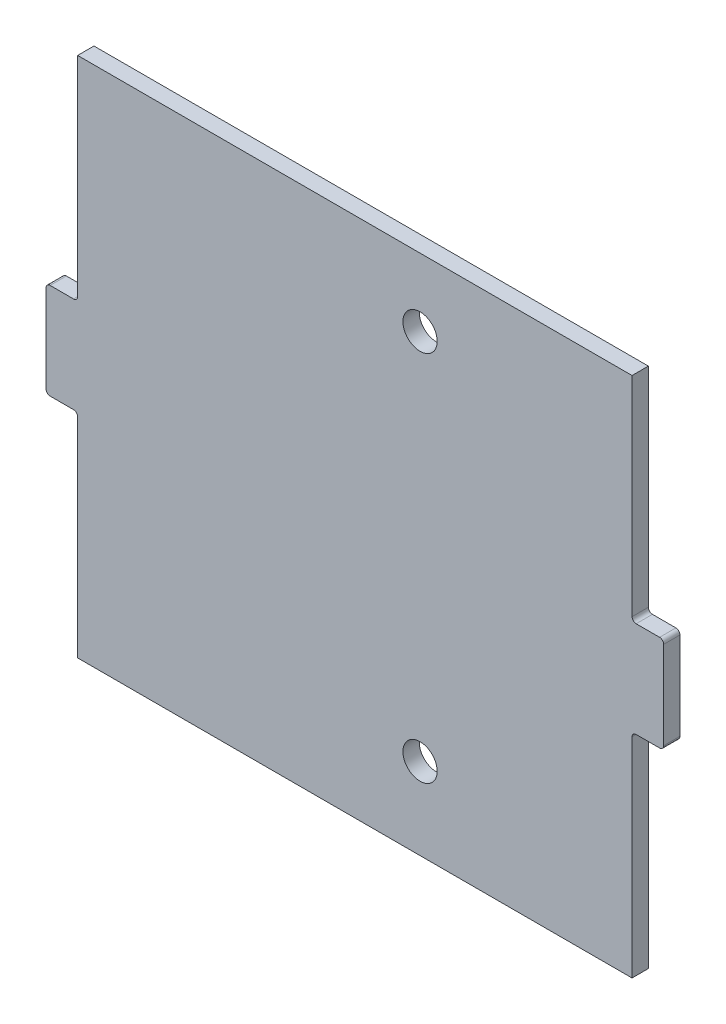
ISO-10303-21;
HEADER;
FILE_DESCRIPTION(('STEP AP214'),'2;1');
FILE_NAME('part.step','',(''),(''),'','','');
FILE_SCHEMA(('AUTOMOTIVE_DESIGN { 1 0 10303 214 1 1 1 1 }'));
ENDSEC;
DATA;
#1=APPLICATION_CONTEXT('core data for automotive mechanical design processes');
#2=APPLICATION_PROTOCOL_DEFINITION('international standard','automotive_design',2000,#1);
#3=PRODUCT_CONTEXT('',#1,'mechanical');
#4=PRODUCT('Part','Part','',(#3));
#5=PRODUCT_RELATED_PRODUCT_CATEGORY('part','',(#4));
#6=PRODUCT_DEFINITION_FORMATION('','',#4);
#7=PRODUCT_DEFINITION_CONTEXT('part definition',#1,'design');
#8=PRODUCT_DEFINITION('design','',#6,#7);
#9=PRODUCT_DEFINITION_SHAPE('','',#8);
#10=(LENGTH_UNIT() NAMED_UNIT(*) SI_UNIT(.MILLI.,.METRE.));
#11=(NAMED_UNIT(*) PLANE_ANGLE_UNIT() SI_UNIT($,.RADIAN.));
#12=(NAMED_UNIT(*) SI_UNIT($,.STERADIAN.) SOLID_ANGLE_UNIT());
#13=UNCERTAINTY_MEASURE_WITH_UNIT(LENGTH_MEASURE(1.E-05),#10,'distance_accuracy_value','');
#14=(GEOMETRIC_REPRESENTATION_CONTEXT(3) GLOBAL_UNCERTAINTY_ASSIGNED_CONTEXT((#13)) GLOBAL_UNIT_ASSIGNED_CONTEXT((#10,
#11,#12)) REPRESENTATION_CONTEXT('',''));
#15=CARTESIAN_POINT('',(0.,0.,0.));
#16=DIRECTION('',(0.,0.,1.));
#17=DIRECTION('',(1.,0.,0.));
#18=AXIS2_PLACEMENT_3D('',#15,#16,#17);
#19=CARTESIAN_POINT('',(215.9,-38.1,6.35));
#20=DIRECTION('',(-1.,0.,0.));
#21=DIRECTION('',(0.,-1.,0.));
#22=AXIS2_PLACEMENT_3D('',#19,#20,#21);
#23=PLANE('',#22);
#24=DIRECTION('',(0.,1.,0.));
#25=VECTOR('',#24,1.);
#26=CARTESIAN_POINT('',(215.9,-38.1,-6.35));
#27=LINE('',#26,#25);
#28=CARTESIAN_POINT('',(215.9,-203.2,-6.35));
#29=VERTEX_POINT('',#28);
#30=CARTESIAN_POINT('',(215.9,-40.513,-6.35));
#31=VERTEX_POINT('',#30);
#32=EDGE_CURVE('E202',#29,#31,#27,.T.);
#33=ORIENTED_EDGE('',*,*,#32,.T.);
#34=DIRECTION('',(0.,0.,-1.));
#35=VECTOR('',#34,1.);
#36=CARTESIAN_POINT('',(215.9,-40.513,6.35));
#37=LINE('',#36,#35);
#38=CARTESIAN_POINT('',(215.9,-40.513,6.35));
#39=VERTEX_POINT('',#38);
#40=EDGE_CURVE('E359',#31,#39,#37,.F.);
#41=ORIENTED_EDGE('',*,*,#40,.T.);
#42=DIRECTION('',(0.,1.,0.));
#43=VECTOR('',#42,1.);
#44=CARTESIAN_POINT('',(215.9,-38.1,6.35));
#45=LINE('',#44,#43);
#46=CARTESIAN_POINT('',(215.9,-203.2,6.35));
#47=VERTEX_POINT('',#46);
#48=EDGE_CURVE('E205',#47,#39,#45,.T.);
#49=ORIENTED_EDGE('',*,*,#48,.F.);
#50=DIRECTION('',(0.,0.,-1.));
#51=VECTOR('',#50,1.);
#52=CARTESIAN_POINT('',(215.9,-203.2,6.35));
#53=LINE('',#52,#51);
#54=EDGE_CURVE('E190',#47,#29,#53,.T.);
#55=ORIENTED_EDGE('',*,*,#54,.T.);
#56=EDGE_LOOP('',(#33,#41,#49,#55));
#57=FACE_BOUND('',#56,.T.);
#58=ADVANCED_FACE('F44',(#57),#23,.F.);
#59=CARTESIAN_POINT('',(215.9,-37.338,6.35));
#60=DIRECTION('',(0.,1.,0.));
#61=DIRECTION('',(-1.,0.,0.));
#62=AXIS2_PLACEMENT_3D('',#59,#60,#61);
#63=PLANE('',#62);
#64=DIRECTION('',(1.,0.,0.));
#65=VECTOR('',#64,1.);
#66=CARTESIAN_POINT('',(215.9,-37.338,-6.35));
#67=LINE('',#66,#65);
#68=CARTESIAN_POINT('',(219.075,-37.338,-6.35));
#69=VERTEX_POINT('',#68);
#70=CARTESIAN_POINT('',(237.363,-37.338,-6.35));
#71=VERTEX_POINT('',#70);
#72=EDGE_CURVE('E207',#69,#71,#67,.T.);
#73=ORIENTED_EDGE('',*,*,#72,.T.);
#74=DIRECTION('',(0.,0.,-1.));
#75=VECTOR('',#74,1.);
#76=CARTESIAN_POINT('',(237.363,-37.338,6.35));
#77=LINE('',#76,#75);
#78=CARTESIAN_POINT('',(237.363,-37.338,6.35));
#79=VERTEX_POINT('',#78);
#80=EDGE_CURVE('E356',#71,#79,#77,.F.);
#81=ORIENTED_EDGE('',*,*,#80,.T.);
#82=DIRECTION('',(1.,0.,0.));
#83=VECTOR('',#82,1.);
#84=CARTESIAN_POINT('',(215.9,-37.338,6.35));
#85=LINE('',#84,#83);
#86=CARTESIAN_POINT('',(219.075,-37.338,6.35));
#87=VERTEX_POINT('',#86);
#88=EDGE_CURVE('E238',#87,#79,#85,.T.);
#89=ORIENTED_EDGE('',*,*,#88,.F.);
#90=DIRECTION('',(0.,0.,-1.));
#91=VECTOR('',#90,1.);
#92=CARTESIAN_POINT('',(219.075,-37.338,-6.35));
#93=LINE('',#92,#91);
#94=EDGE_CURVE('E352',#87,#69,#93,.T.);
#95=ORIENTED_EDGE('',*,*,#94,.T.);
#96=EDGE_LOOP('',(#73,#81,#89,#95));
#97=FACE_BOUND('',#96,.T.);
#98=ADVANCED_FACE('F412',(#97),#63,.F.);
#99=CARTESIAN_POINT('',(240.538,38.1,6.35));
#100=DIRECTION('',(-1.,0.,0.));
#101=DIRECTION('',(0.,0.,1.));
#102=AXIS2_PLACEMENT_3D('',#99,#100,#101);
#103=PLANE('',#102);
#104=DIRECTION('',(0.,1.,0.));
#105=VECTOR('',#104,1.);
#106=CARTESIAN_POINT('',(240.538,38.1,-6.35));
#107=LINE('',#106,#105);
#108=CARTESIAN_POINT('',(240.538,-34.163,-6.35));
#109=VERTEX_POINT('',#108);
#110=CARTESIAN_POINT('',(240.538,34.163,-6.35));
#111=VERTEX_POINT('',#110);
#112=EDGE_CURVE('E243',#109,#111,#107,.T.);
#113=ORIENTED_EDGE('',*,*,#112,.T.);
#114=DIRECTION('',(0.,0.,-1.));
#115=VECTOR('',#114,1.);
#116=CARTESIAN_POINT('',(240.538,34.163,6.35));
#117=LINE('',#116,#115);
#118=CARTESIAN_POINT('',(240.538,34.163,6.35));
#119=VERTEX_POINT('',#118);
#120=EDGE_CURVE('E349',#111,#119,#117,.F.);
#121=ORIENTED_EDGE('',*,*,#120,.T.);
#122=DIRECTION('',(0.,1.,0.));
#123=VECTOR('',#122,1.);
#124=CARTESIAN_POINT('',(240.538,38.1,6.35));
#125=LINE('',#124,#123);
#126=CARTESIAN_POINT('',(240.538,-34.163,6.35));
#127=VERTEX_POINT('',#126);
#128=EDGE_CURVE('E247',#127,#119,#125,.T.);
#129=ORIENTED_EDGE('',*,*,#128,.F.);
#130=DIRECTION('',(0.,0.,-1.));
#131=VECTOR('',#130,1.);
#132=CARTESIAN_POINT('',(240.538,-34.163,6.35));
#133=LINE('',#132,#131);
#134=EDGE_CURVE('E345',#127,#109,#133,.T.);
#135=ORIENTED_EDGE('',*,*,#134,.T.);
#136=EDGE_LOOP('',(#113,#121,#129,#135));
#137=FACE_BOUND('',#136,.T.);
#138=ADVANCED_FACE('F418',(#137),#103,.F.);
#139=CARTESIAN_POINT('',(215.9,37.338,6.35));
#140=DIRECTION('',(0.,-1.,0.));
#141=DIRECTION('',(0.,0.,-1.));
#142=AXIS2_PLACEMENT_3D('',#139,#140,#141);
#143=PLANE('',#142);
#144=DIRECTION('',(-1.,0.,0.));
#145=VECTOR('',#144,1.);
#146=CARTESIAN_POINT('',(215.9,37.338,-6.35));
#147=LINE('',#146,#145);
#148=CARTESIAN_POINT('',(237.363,37.338,-6.35));
#149=VERTEX_POINT('',#148);
#150=CARTESIAN_POINT('',(219.075,37.338,-6.35));
#151=VERTEX_POINT('',#150);
#152=EDGE_CURVE('E254',#149,#151,#147,.T.);
#153=ORIENTED_EDGE('',*,*,#152,.T.);
#154=DIRECTION('',(0.,0.,-1.));
#155=VECTOR('',#154,1.);
#156=CARTESIAN_POINT('',(219.075,37.338,6.35));
#157=LINE('',#156,#155);
#158=CARTESIAN_POINT('',(219.075,37.338,6.35));
#159=VERTEX_POINT('',#158);
#160=EDGE_CURVE('E342',#151,#159,#157,.F.);
#161=ORIENTED_EDGE('',*,*,#160,.T.);
#162=DIRECTION('',(-1.,0.,0.));
#163=VECTOR('',#162,1.);
#164=CARTESIAN_POINT('',(215.9,37.338,6.35));
#165=LINE('',#164,#163);
#166=CARTESIAN_POINT('',(237.363,37.338,6.35));
#167=VERTEX_POINT('',#166);
#168=EDGE_CURVE('E235',#167,#159,#165,.T.);
#169=ORIENTED_EDGE('',*,*,#168,.F.);
#170=DIRECTION('',(0.,0.,-1.));
#171=VECTOR('',#170,1.);
#172=CARTESIAN_POINT('',(237.363,37.338,6.35));
#173=LINE('',#172,#171);
#174=EDGE_CURVE('E338',#167,#149,#173,.T.);
#175=ORIENTED_EDGE('',*,*,#174,.T.);
#176=EDGE_LOOP('',(#153,#161,#169,#175));
#177=FACE_BOUND('',#176,.T.);
#178=ADVANCED_FACE('F426',(#177),#143,.F.);
#179=CARTESIAN_POINT('',(215.9,203.2,6.35));
#180=DIRECTION('',(-1.,0.,0.));
#181=DIRECTION('',(0.,-1.,0.));
#182=AXIS2_PLACEMENT_3D('',#179,#180,#181);
#183=PLANE('',#182);
#184=DIRECTION('',(0.,1.,0.));
#185=VECTOR('',#184,1.);
#186=CARTESIAN_POINT('',(215.9,203.2,6.35));
#187=LINE('',#186,#185);
#188=CARTESIAN_POINT('',(215.9,40.513,6.35));
#189=VERTEX_POINT('',#188);
#190=CARTESIAN_POINT('',(215.9,203.2,6.35));
#191=VERTEX_POINT('',#190);
#192=EDGE_CURVE('E232',#189,#191,#187,.T.);
#193=ORIENTED_EDGE('',*,*,#192,.F.);
#194=DIRECTION('',(0.,0.,-1.));
#195=VECTOR('',#194,1.);
#196=CARTESIAN_POINT('',(215.9,40.513,-6.35));
#197=LINE('',#196,#195);
#198=CARTESIAN_POINT('',(215.9,40.513,-6.35));
#199=VERTEX_POINT('',#198);
#200=EDGE_CURVE('E334',#189,#199,#197,.T.);
#201=ORIENTED_EDGE('',*,*,#200,.T.);
#202=DIRECTION('',(0.,1.,0.));
#203=VECTOR('',#202,1.);
#204=CARTESIAN_POINT('',(215.9,203.2,-6.35));
#205=LINE('',#204,#203);
#206=CARTESIAN_POINT('',(215.9,203.2,-6.35));
#207=VERTEX_POINT('',#206);
#208=EDGE_CURVE('E216',#199,#207,#205,.T.);
#209=ORIENTED_EDGE('',*,*,#208,.T.);
#210=DIRECTION('',(0.,0.,-1.));
#211=VECTOR('',#210,1.);
#212=CARTESIAN_POINT('',(215.9,203.2,6.35));
#213=LINE('',#212,#211);
#214=EDGE_CURVE('E683',#191,#207,#213,.T.);
#215=ORIENTED_EDGE('',*,*,#214,.F.);
#216=EDGE_LOOP('',(#193,#201,#209,#215));
#217=FACE_BOUND('',#216,.T.);
#218=ADVANCED_FACE('F422',(#217),#183,.F.);
#219=CARTESIAN_POINT('',(-215.9,203.2,6.35));
#220=DIRECTION('',(0.,-1.,0.));
#221=DIRECTION('',(0.,0.,-1.));
#222=AXIS2_PLACEMENT_3D('',#219,#220,#221);
#223=PLANE('',#222);
#224=DIRECTION('',(-1.,0.,0.));
#225=VECTOR('',#224,1.);
#226=CARTESIAN_POINT('',(-215.9,203.2,-6.35));
#227=LINE('',#226,#225);
#228=CARTESIAN_POINT('',(-215.9,203.2,-6.35));
#229=VERTEX_POINT('',#228);
#230=EDGE_CURVE('E688',#207,#229,#227,.T.);
#231=ORIENTED_EDGE('',*,*,#230,.T.);
#232=DIRECTION('',(0.,0.,-1.));
#233=VECTOR('',#232,1.);
#234=CARTESIAN_POINT('',(-215.9,203.2,6.35));
#235=LINE('',#234,#233);
#236=CARTESIAN_POINT('',(-215.9,203.2,6.35));
#237=VERTEX_POINT('',#236);
#238=EDGE_CURVE('E265',#237,#229,#235,.T.);
#239=ORIENTED_EDGE('',*,*,#238,.F.);
#240=DIRECTION('',(-1.,0.,0.));
#241=VECTOR('',#240,1.);
#242=CARTESIAN_POINT('',(-215.9,203.2,6.35));
#243=LINE('',#242,#241);
#244=EDGE_CURVE('E229',#191,#237,#243,.T.);
#245=ORIENTED_EDGE('',*,*,#244,.F.);
#246=ORIENTED_EDGE('',*,*,#214,.T.);
#247=EDGE_LOOP('',(#231,#239,#245,#246));
#248=FACE_BOUND('',#247,.T.);
#249=ADVANCED_FACE('F425',(#248),#223,.F.);
#250=CARTESIAN_POINT('',(-215.9,203.2,6.35));
#251=DIRECTION('',(1.,0.,0.));
#252=DIRECTION('',(0.,0.,-1.));
#253=AXIS2_PLACEMENT_3D('',#250,#251,#252);
#254=PLANE('',#253);
#255=DIRECTION('',(0.,-1.,0.));
#256=VECTOR('',#255,1.);
#257=CARTESIAN_POINT('',(-215.9,203.2,-6.35));
#258=LINE('',#257,#256);
#259=CARTESIAN_POINT('',(-215.9,40.513,-6.35));
#260=VERTEX_POINT('',#259);
#261=EDGE_CURVE('E687',#229,#260,#258,.T.);
#262=ORIENTED_EDGE('',*,*,#261,.T.);
#263=DIRECTION('',(0.,0.,-1.));
#264=VECTOR('',#263,1.);
#265=CARTESIAN_POINT('',(-215.9,40.513,6.35));
#266=LINE('',#265,#264);
#267=CARTESIAN_POINT('',(-215.9,40.513,6.35));
#268=VERTEX_POINT('',#267);
#269=EDGE_CURVE('E331',#260,#268,#266,.F.);
#270=ORIENTED_EDGE('',*,*,#269,.T.);
#271=DIRECTION('',(0.,-1.,0.));
#272=VECTOR('',#271,1.);
#273=CARTESIAN_POINT('',(-215.9,203.2,6.35));
#274=LINE('',#273,#272);
#275=EDGE_CURVE('E225',#237,#268,#274,.T.);
#276=ORIENTED_EDGE('',*,*,#275,.F.);
#277=ORIENTED_EDGE('',*,*,#238,.T.);
#278=EDGE_LOOP('',(#262,#270,#276,#277));
#279=FACE_BOUND('',#278,.T.);
#280=ADVANCED_FACE('F430',(#279),#254,.F.);
#281=CARTESIAN_POINT('',(-215.9,37.338,6.35));
#282=DIRECTION('',(0.,-1.,0.));
#283=DIRECTION('',(1.,0.,0.));
#284=AXIS2_PLACEMENT_3D('',#281,#282,#283);
#285=PLANE('',#284);
#286=DIRECTION('',(-1.,0.,0.));
#287=VECTOR('',#286,1.);
#288=CARTESIAN_POINT('',(-215.9,37.338,6.35));
#289=LINE('',#288,#287);
#290=CARTESIAN_POINT('',(-219.075,37.338,6.35));
#291=VERTEX_POINT('',#290);
#292=CARTESIAN_POINT('',(-237.363,37.338,6.35));
#293=VERTEX_POINT('',#292);
#294=EDGE_CURVE('E228',#291,#293,#289,.T.);
#295=ORIENTED_EDGE('',*,*,#294,.F.);
#296=DIRECTION('',(0.,0.,-1.));
#297=VECTOR('',#296,1.);
#298=CARTESIAN_POINT('',(-219.075,37.338,-6.35));
#299=LINE('',#298,#297);
#300=CARTESIAN_POINT('',(-219.075,37.338,-6.35));
#301=VERTEX_POINT('',#300);
#302=EDGE_CURVE('E327',#291,#301,#299,.T.);
#303=ORIENTED_EDGE('',*,*,#302,.T.);
#304=DIRECTION('',(-1.,0.,0.));
#305=VECTOR('',#304,1.);
#306=CARTESIAN_POINT('',(-215.9,37.338,-6.35));
#307=LINE('',#306,#305);
#308=CARTESIAN_POINT('',(-237.363,37.338,-6.35));
#309=VERTEX_POINT('',#308);
#310=EDGE_CURVE('E261',#301,#309,#307,.T.);
#311=ORIENTED_EDGE('',*,*,#310,.T.);
#312=DIRECTION('',(0.,0.,-1.));
#313=VECTOR('',#312,1.);
#314=CARTESIAN_POINT('',(-237.363,37.338,6.35));
#315=LINE('',#314,#313);
#316=EDGE_CURVE('E62',#309,#293,#315,.F.);
#317=ORIENTED_EDGE('',*,*,#316,.T.);
#318=EDGE_LOOP('',(#295,#303,#311,#317));
#319=FACE_BOUND('',#318,.T.);
#320=ADVANCED_FACE('F434',(#319),#285,.F.);
#321=CARTESIAN_POINT('',(-240.538,38.1,6.35));
#322=DIRECTION('',(1.,0.,0.));
#323=DIRECTION('',(0.,0.,-1.));
#324=AXIS2_PLACEMENT_3D('',#321,#322,#323);
#325=PLANE('',#324);
#326=DIRECTION('',(0.,-1.,0.));
#327=VECTOR('',#326,1.);
#328=CARTESIAN_POINT('',(-240.538,38.1,-6.35));
#329=LINE('',#328,#327);
#330=CARTESIAN_POINT('',(-240.538,34.163,-6.35));
#331=VERTEX_POINT('',#330);
#332=CARTESIAN_POINT('',(-240.538,-34.163,-6.35));
#333=VERTEX_POINT('',#332);
#334=EDGE_CURVE('E264',#331,#333,#329,.T.);
#335=ORIENTED_EDGE('',*,*,#334,.T.);
#336=DIRECTION('',(0.,0.,-1.));
#337=VECTOR('',#336,1.);
#338=CARTESIAN_POINT('',(-240.538,-34.163,6.35));
#339=LINE('',#338,#337);
#340=CARTESIAN_POINT('',(-240.538,-34.163,6.35));
#341=VERTEX_POINT('',#340);
#342=EDGE_CURVE('E310',#333,#341,#339,.F.);
#343=ORIENTED_EDGE('',*,*,#342,.T.);
#344=DIRECTION('',(0.,-1.,0.));
#345=VECTOR('',#344,1.);
#346=CARTESIAN_POINT('',(-240.538,38.1,6.35));
#347=LINE('',#346,#345);
#348=CARTESIAN_POINT('',(-240.538,34.163,6.35));
#349=VERTEX_POINT('',#348);
#350=EDGE_CURVE('E268',#349,#341,#347,.T.);
#351=ORIENTED_EDGE('',*,*,#350,.F.);
#352=DIRECTION('',(0.,0.,-1.));
#353=VECTOR('',#352,1.);
#354=CARTESIAN_POINT('',(-240.538,34.163,6.35));
#355=LINE('',#354,#353);
#356=EDGE_CURVE('E306',#349,#331,#355,.T.);
#357=ORIENTED_EDGE('',*,*,#356,.T.);
#358=EDGE_LOOP('',(#335,#343,#351,#357));
#359=FACE_BOUND('',#358,.T.);
#360=ADVANCED_FACE('F469',(#359),#325,.F.);
#361=CARTESIAN_POINT('',(-215.9,-37.338,6.35));
#362=DIRECTION('',(0.,1.,0.));
#363=DIRECTION('',(-1.,0.,0.));
#364=AXIS2_PLACEMENT_3D('',#361,#362,#363);
#365=PLANE('',#364);
#366=DIRECTION('',(1.,0.,0.));
#367=VECTOR('',#366,1.);
#368=CARTESIAN_POINT('',(-215.9,-37.338,-6.35));
#369=LINE('',#368,#367);
#370=CARTESIAN_POINT('',(-237.363,-37.338,-6.35));
#371=VERTEX_POINT('',#370);
#372=CARTESIAN_POINT('',(-219.075,-37.338,-6.35));
#373=VERTEX_POINT('',#372);
#374=EDGE_CURVE('E275',#371,#373,#369,.T.);
#375=ORIENTED_EDGE('',*,*,#374,.T.);
#376=DIRECTION('',(0.,0.,-1.));
#377=VECTOR('',#376,1.);
#378=CARTESIAN_POINT('',(-219.075,-37.338,6.35));
#379=LINE('',#378,#377);
#380=CARTESIAN_POINT('',(-219.075,-37.338,6.35));
#381=VERTEX_POINT('',#380);
#382=EDGE_CURVE('E291',#373,#381,#379,.F.);
#383=ORIENTED_EDGE('',*,*,#382,.T.);
#384=DIRECTION('',(1.,0.,0.));
#385=VECTOR('',#384,1.);
#386=CARTESIAN_POINT('',(-215.9,-37.338,6.35));
#387=LINE('',#386,#385);
#388=CARTESIAN_POINT('',(-237.363,-37.338,6.35));
#389=VERTEX_POINT('',#388);
#390=EDGE_CURVE('E224',#389,#381,#387,.T.);
#391=ORIENTED_EDGE('',*,*,#390,.F.);
#392=DIRECTION('',(0.,0.,-1.));
#393=VECTOR('',#392,1.);
#394=CARTESIAN_POINT('',(-237.363,-37.338,6.35));
#395=LINE('',#394,#393);
#396=EDGE_CURVE('E286',#389,#371,#395,.T.);
#397=ORIENTED_EDGE('',*,*,#396,.T.);
#398=EDGE_LOOP('',(#375,#383,#391,#397));
#399=FACE_BOUND('',#398,.T.);
#400=ADVANCED_FACE('F438',(#399),#365,.F.);
#401=CARTESIAN_POINT('',(-215.9,-38.1,6.35));
#402=DIRECTION('',(1.,0.,0.));
#403=DIRECTION('',(0.,1.,0.));
#404=AXIS2_PLACEMENT_3D('',#401,#402,#403);
#405=PLANE('',#404);
#406=DIRECTION('',(0.,-1.,0.));
#407=VECTOR('',#406,1.);
#408=CARTESIAN_POINT('',(-215.9,-38.1,6.35));
#409=LINE('',#408,#407);
#410=CARTESIAN_POINT('',(-215.9,-40.513,6.35));
#411=VERTEX_POINT('',#410);
#412=CARTESIAN_POINT('',(-215.9,-203.2,6.35));
#413=VERTEX_POINT('',#412);
#414=EDGE_CURVE('E221',#411,#413,#409,.T.);
#415=ORIENTED_EDGE('',*,*,#414,.F.);
#416=DIRECTION('',(0.,0.,-1.));
#417=VECTOR('',#416,1.);
#418=CARTESIAN_POINT('',(-215.9,-40.513,-6.35));
#419=LINE('',#418,#417);
#420=CARTESIAN_POINT('',(-215.9,-40.513,-6.35));
#421=VERTEX_POINT('',#420);
#422=EDGE_CURVE('E282',#411,#421,#419,.T.);
#423=ORIENTED_EDGE('',*,*,#422,.T.);
#424=DIRECTION('',(0.,-1.,0.));
#425=VECTOR('',#424,1.);
#426=CARTESIAN_POINT('',(-215.9,-38.1,-6.35));
#427=LINE('',#426,#425);
#428=CARTESIAN_POINT('',(-215.9,-203.2,-6.35));
#429=VERTEX_POINT('',#428);
#430=EDGE_CURVE('E198',#421,#429,#427,.T.);
#431=ORIENTED_EDGE('',*,*,#430,.T.);
#432=DIRECTION('',(0.,0.,-1.));
#433=VECTOR('',#432,1.);
#434=CARTESIAN_POINT('',(-215.9,-203.2,6.35));
#435=LINE('',#434,#433);
#436=EDGE_CURVE('E193',#413,#429,#435,.T.);
#437=ORIENTED_EDGE('',*,*,#436,.F.);
#438=EDGE_LOOP('',(#415,#423,#431,#437));
#439=FACE_BOUND('',#438,.T.);
#440=ADVANCED_FACE('F436',(#439),#405,.F.);
#441=CARTESIAN_POINT('',(-215.9,-203.2,6.35));
#442=DIRECTION('',(0.,1.,0.));
#443=DIRECTION('',(0.,0.,1.));
#444=AXIS2_PLACEMENT_3D('',#441,#442,#443);
#445=PLANE('',#444);
#446=DIRECTION('',(1.,0.,0.));
#447=VECTOR('',#446,1.);
#448=CARTESIAN_POINT('',(-215.9,-203.2,-6.35));
#449=LINE('',#448,#447);
#450=EDGE_CURVE('E186',#429,#29,#449,.T.);
#451=ORIENTED_EDGE('',*,*,#450,.T.);
#452=ORIENTED_EDGE('',*,*,#54,.F.);
#453=DIRECTION('',(1.,0.,0.));
#454=VECTOR('',#453,1.);
#455=CARTESIAN_POINT('',(-215.9,-203.2,6.35));
#456=LINE('',#455,#454);
#457=EDGE_CURVE('E218',#413,#47,#456,.T.);
#458=ORIENTED_EDGE('',*,*,#457,.F.);
#459=ORIENTED_EDGE('',*,*,#436,.T.);
#460=EDGE_LOOP('',(#451,#452,#458,#459));
#461=FACE_BOUND('',#460,.T.);
#462=ADVANCED_FACE('F188',(#461),#445,.F.);
#463=CARTESIAN_POINT('',(0.,0.,6.35));
#464=DIRECTION('',(0.,0.,1.));
#465=DIRECTION('',(1.,0.,0.));
#466=AXIS2_PLACEMENT_3D('',#463,#464,#465);
#467=PLANE('',#466);
#468=CARTESIAN_POINT('',(50.8000000000004,150.299999999983,6.34999999999999));
#469=DIRECTION('',(0.,0.,1.));
#470=DIRECTION('',(1.,0.,0.));
#471=AXIS2_PLACEMENT_3D('',#468,#469,#470);
#472=CIRCLE('',#471,13.3350000000001);
#473=CARTESIAN_POINT('',(64.1350000000005,150.299999999983,6.34999999999999));
#474=VERTEX_POINT('',#473);
#475=EDGE_CURVE('E381',#474,#474,#472,.F.);
#476=ORIENTED_EDGE('',*,*,#475,.T.);
#477=EDGE_LOOP('',(#476));
#478=FACE_BOUND('',#477,.T.);
#479=CARTESIAN_POINT('',(50.8000000000004,-139.700000000005,6.34999999999999));
#480=DIRECTION('',(0.,0.,1.));
#481=DIRECTION('',(1.,0.,0.));
#482=AXIS2_PLACEMENT_3D('',#479,#480,#481);
#483=CIRCLE('',#482,13.3350000000001);
#484=CARTESIAN_POINT('',(64.1350000000005,-139.700000000005,6.34999999999999));
#485=VERTEX_POINT('',#484);
#486=EDGE_CURVE('E239',#485,#485,#483,.F.);
#487=ORIENTED_EDGE('',*,*,#486,.T.);
#488=EDGE_LOOP('',(#487));
#489=FACE_BOUND('',#488,.T.);
#490=ORIENTED_EDGE('',*,*,#350,.T.);
#491=CARTESIAN_POINT('',(-237.363,-34.163,6.35));
#492=DIRECTION('',(0.,0.,1.));
#493=DIRECTION('',(1.,0.,0.));
#494=AXIS2_PLACEMENT_3D('',#491,#492,#493);
#495=CIRCLE('',#494,3.175);
#496=EDGE_CURVE('E322',#341,#389,#495,.T.);
#497=ORIENTED_EDGE('',*,*,#496,.T.);
#498=ORIENTED_EDGE('',*,*,#390,.T.);
#499=CARTESIAN_POINT('',(-219.075,-40.513,6.35));
#500=DIRECTION('',(0.,0.,1.));
#501=DIRECTION('',(1.,0.,0.));
#502=AXIS2_PLACEMENT_3D('',#499,#500,#501);
#503=CIRCLE('',#502,3.175);
#504=EDGE_CURVE('E365',#381,#411,#503,.F.);
#505=ORIENTED_EDGE('',*,*,#504,.T.);
#506=ORIENTED_EDGE('',*,*,#414,.T.);
#507=ORIENTED_EDGE('',*,*,#457,.T.);
#508=ORIENTED_EDGE('',*,*,#48,.T.);
#509=CARTESIAN_POINT('',(219.075,-40.513,6.35));
#510=DIRECTION('',(0.,0.,1.));
#511=DIRECTION('',(1.,0.,0.));
#512=AXIS2_PLACEMENT_3D('',#509,#510,#511);
#513=CIRCLE('',#512,3.175);
#514=EDGE_CURVE('E12',#39,#87,#513,.F.);
#515=ORIENTED_EDGE('',*,*,#514,.T.);
#516=ORIENTED_EDGE('',*,*,#88,.T.);
#517=CARTESIAN_POINT('',(237.363,-34.163,6.35));
#518=DIRECTION('',(0.,0.,1.));
#519=DIRECTION('',(1.,0.,0.));
#520=AXIS2_PLACEMENT_3D('',#517,#518,#519);
#521=CIRCLE('',#520,3.175);
#522=EDGE_CURVE('E316',#79,#127,#521,.T.);
#523=ORIENTED_EDGE('',*,*,#522,.T.);
#524=ORIENTED_EDGE('',*,*,#128,.T.);
#525=CARTESIAN_POINT('',(237.363,34.163,6.35));
#526=DIRECTION('',(0.,0.,1.));
#527=DIRECTION('',(1.,0.,0.));
#528=AXIS2_PLACEMENT_3D('',#525,#526,#527);
#529=CIRCLE('',#528,3.175);
#530=EDGE_CURVE('E319',#119,#167,#529,.T.);
#531=ORIENTED_EDGE('',*,*,#530,.T.);
#532=ORIENTED_EDGE('',*,*,#168,.T.);
#533=CARTESIAN_POINT('',(219.075,40.513,6.35));
#534=DIRECTION('',(0.,0.,1.));
#535=DIRECTION('',(1.,0.,0.));
#536=AXIS2_PLACEMENT_3D('',#533,#534,#535);
#537=CIRCLE('',#536,3.175);
#538=EDGE_CURVE('E376',#159,#189,#537,.F.);
#539=ORIENTED_EDGE('',*,*,#538,.T.);
#540=ORIENTED_EDGE('',*,*,#192,.T.);
#541=ORIENTED_EDGE('',*,*,#244,.T.);
#542=ORIENTED_EDGE('',*,*,#275,.T.);
#543=CARTESIAN_POINT('',(-219.075,40.513,6.35));
#544=DIRECTION('',(0.,0.,1.));
#545=DIRECTION('',(1.,0.,0.));
#546=AXIS2_PLACEMENT_3D('',#543,#544,#545);
#547=CIRCLE('',#546,3.175);
#548=EDGE_CURVE('E69',#268,#291,#547,.F.);
#549=ORIENTED_EDGE('',*,*,#548,.T.);
#550=ORIENTED_EDGE('',*,*,#294,.T.);
#551=CARTESIAN_POINT('',(-237.363,34.163,6.35));
#552=DIRECTION('',(0.,0.,1.));
#553=DIRECTION('',(1.,0.,0.));
#554=AXIS2_PLACEMENT_3D('',#551,#552,#553);
#555=CIRCLE('',#554,3.175);
#556=EDGE_CURVE('E313',#293,#349,#555,.T.);
#557=ORIENTED_EDGE('',*,*,#556,.T.);
#558=EDGE_LOOP('',(#490,#497,#498,#505,#506,#507,#508,#515,#516,#523,#524,#531,#532,#539,#540,
#541,#542,#549,#550,#557));
#559=FACE_BOUND('',#558,.T.);
#560=ADVANCED_FACE('F391',(#478,#489,#559),#467,.T.);
#561=CARTESIAN_POINT('',(0.,0.,-6.35));
#562=DIRECTION('',(0.,0.,1.));
#563=DIRECTION('',(1.,0.,0.));
#564=AXIS2_PLACEMENT_3D('',#561,#562,#563);
#565=PLANE('',#564);
#566=CARTESIAN_POINT('',(50.8000000000004,150.299999999983,-6.35000000000002));
#567=DIRECTION('',(0.,0.,1.));
#568=DIRECTION('',(1.,0.,0.));
#569=AXIS2_PLACEMENT_3D('',#566,#567,#568);
#570=CIRCLE('',#569,13.3350000000001);
#571=CARTESIAN_POINT('',(64.1350000000005,150.299999999983,-6.35000000000002));
#572=VERTEX_POINT('',#571);
#573=EDGE_CURVE('E287',#572,#572,#570,.F.);
#574=ORIENTED_EDGE('',*,*,#573,.F.);
#575=EDGE_LOOP('',(#574));
#576=FACE_BOUND('',#575,.T.);
#577=CARTESIAN_POINT('',(50.8000000000004,-139.700000000005,-6.34999999999999));
#578=DIRECTION('',(0.,0.,1.));
#579=DIRECTION('',(1.,0.,0.));
#580=AXIS2_PLACEMENT_3D('',#577,#578,#579);
#581=CIRCLE('',#580,13.3350000000001);
#582=CARTESIAN_POINT('',(64.1350000000005,-139.700000000005,-6.34999999999999));
#583=VERTEX_POINT('',#582);
#584=EDGE_CURVE('E48',#583,#583,#581,.F.);
#585=ORIENTED_EDGE('',*,*,#584,.F.);
#586=EDGE_LOOP('',(#585));
#587=FACE_BOUND('',#586,.T.);
#588=ORIENTED_EDGE('',*,*,#374,.F.);
#589=CARTESIAN_POINT('',(-237.363,-34.163,-6.35));
#590=DIRECTION('',(0.,0.,1.));
#591=DIRECTION('',(1.,0.,0.));
#592=AXIS2_PLACEMENT_3D('',#589,#590,#591);
#593=CIRCLE('',#592,3.175);
#594=EDGE_CURVE('E303',#371,#333,#593,.F.);
#595=ORIENTED_EDGE('',*,*,#594,.T.);
#596=ORIENTED_EDGE('',*,*,#334,.F.);
#597=CARTESIAN_POINT('',(-237.363,34.163,-6.35));
#598=DIRECTION('',(0.,0.,1.));
#599=DIRECTION('',(1.,0.,0.));
#600=AXIS2_PLACEMENT_3D('',#597,#598,#599);
#601=CIRCLE('',#600,3.175);
#602=EDGE_CURVE('E294',#331,#309,#601,.F.);
#603=ORIENTED_EDGE('',*,*,#602,.T.);
#604=ORIENTED_EDGE('',*,*,#310,.F.);
#605=CARTESIAN_POINT('',(-219.075,40.513,-6.35));
#606=DIRECTION('',(0.,0.,1.));
#607=DIRECTION('',(1.,0.,0.));
#608=AXIS2_PLACEMENT_3D('',#605,#606,#607);
#609=CIRCLE('',#608,3.175);
#610=EDGE_CURVE('E368',#301,#260,#609,.T.);
#611=ORIENTED_EDGE('',*,*,#610,.T.);
#612=ORIENTED_EDGE('',*,*,#261,.F.);
#613=ORIENTED_EDGE('',*,*,#230,.F.);
#614=ORIENTED_EDGE('',*,*,#208,.F.);
#615=CARTESIAN_POINT('',(219.075,40.513,-6.35));
#616=DIRECTION('',(0.,0.,1.));
#617=DIRECTION('',(1.,0.,0.));
#618=AXIS2_PLACEMENT_3D('',#615,#616,#617);
#619=CIRCLE('',#618,3.175);
#620=EDGE_CURVE('E373',#199,#151,#619,.T.);
#621=ORIENTED_EDGE('',*,*,#620,.T.);
#622=ORIENTED_EDGE('',*,*,#152,.F.);
#623=CARTESIAN_POINT('',(237.363,34.163,-6.35));
#624=DIRECTION('',(0.,0.,1.));
#625=DIRECTION('',(1.,0.,0.));
#626=AXIS2_PLACEMENT_3D('',#623,#624,#625);
#627=CIRCLE('',#626,3.175);
#628=EDGE_CURVE('E300',#149,#111,#627,.F.);
#629=ORIENTED_EDGE('',*,*,#628,.T.);
#630=ORIENTED_EDGE('',*,*,#112,.F.);
#631=CARTESIAN_POINT('',(237.363,-34.163,-6.35));
#632=DIRECTION('',(0.,0.,1.));
#633=DIRECTION('',(1.,0.,0.));
#634=AXIS2_PLACEMENT_3D('',#631,#632,#633);
#635=CIRCLE('',#634,3.175);
#636=EDGE_CURVE('E297',#109,#71,#635,.F.);
#637=ORIENTED_EDGE('',*,*,#636,.T.);
#638=ORIENTED_EDGE('',*,*,#72,.F.);
#639=CARTESIAN_POINT('',(219.075,-40.513,-6.35));
#640=DIRECTION('',(0.,0.,1.));
#641=DIRECTION('',(1.,0.,0.));
#642=AXIS2_PLACEMENT_3D('',#639,#640,#641);
#643=CIRCLE('',#642,3.175);
#644=EDGE_CURVE('E54',#69,#31,#643,.T.);
#645=ORIENTED_EDGE('',*,*,#644,.T.);
#646=ORIENTED_EDGE('',*,*,#32,.F.);
#647=ORIENTED_EDGE('',*,*,#450,.F.);
#648=ORIENTED_EDGE('',*,*,#430,.F.);
#649=CARTESIAN_POINT('',(-219.075,-40.513,-6.35));
#650=DIRECTION('',(0.,0.,1.));
#651=DIRECTION('',(1.,0.,0.));
#652=AXIS2_PLACEMENT_3D('',#649,#650,#651);
#653=CIRCLE('',#652,3.175);
#654=EDGE_CURVE('E362',#421,#373,#653,.T.);
#655=ORIENTED_EDGE('',*,*,#654,.T.);
#656=EDGE_LOOP('',(#588,#595,#596,#603,#604,#611,#612,#613,#614,#621,#622,#629,#630,#637,#638,
#645,#646,#647,#648,#655));
#657=FACE_BOUND('',#656,.T.);
#658=ADVANCED_FACE('F210',(#576,#587,#657),#565,.F.);
#659=CARTESIAN_POINT('',(50.8000000000004,-139.700000000005,173.4));
#660=DIRECTION('',(0.,0.,-1.));
#661=DIRECTION('',(-1.,0.,0.));
#662=AXIS2_PLACEMENT_3D('',#659,#660,#661);
#663=CYLINDRICAL_SURFACE('',#662,13.3350000000001);
#664=ORIENTED_EDGE('',*,*,#486,.F.);
#665=EDGE_LOOP('',(#664));
#666=FACE_BOUND('',#665,.T.);
#667=ORIENTED_EDGE('',*,*,#584,.T.);
#668=EDGE_LOOP('',(#667));
#669=FACE_BOUND('',#668,.T.);
#670=ADVANCED_FACE('F46',(#666,#669),#663,.F.);
#671=CARTESIAN_POINT('',(50.8000000000004,150.299999999983,248.4));
#672=DIRECTION('',(0.,0.,-1.));
#673=DIRECTION('',(-1.,0.,0.));
#674=AXIS2_PLACEMENT_3D('',#671,#672,#673);
#675=CYLINDRICAL_SURFACE('',#674,13.3350000000001);
#676=ORIENTED_EDGE('',*,*,#475,.F.);
#677=EDGE_LOOP('',(#676));
#678=FACE_BOUND('',#677,.T.);
#679=ORIENTED_EDGE('',*,*,#573,.T.);
#680=EDGE_LOOP('',(#679));
#681=FACE_BOUND('',#680,.T.);
#682=ADVANCED_FACE('F395',(#678,#681),#675,.F.);
#683=CARTESIAN_POINT('',(-219.075,-40.513,6.35));
#684=DIRECTION('',(0.,0.,1.));
#685=DIRECTION('',(1.,0.,0.));
#686=AXIS2_PLACEMENT_3D('',#683,#684,#685);
#687=CYLINDRICAL_SURFACE('',#686,3.175);
#688=ORIENTED_EDGE('',*,*,#504,.F.);
#689=ORIENTED_EDGE('',*,*,#382,.F.);
#690=ORIENTED_EDGE('',*,*,#654,.F.);
#691=ORIENTED_EDGE('',*,*,#422,.F.);
#692=EDGE_LOOP('',(#688,#689,#690,#691));
#693=FACE_BOUND('',#692,.T.);
#694=ADVANCED_FACE('F501',(#693),#687,.F.);
#695=CARTESIAN_POINT('',(-237.363,-34.163,6.35));
#696=DIRECTION('',(0.,0.,-1.));
#697=DIRECTION('',(-1.,0.,0.));
#698=AXIS2_PLACEMENT_3D('',#695,#696,#697);
#699=CYLINDRICAL_SURFACE('',#698,3.175);
#700=ORIENTED_EDGE('',*,*,#496,.F.);
#701=ORIENTED_EDGE('',*,*,#342,.F.);
#702=ORIENTED_EDGE('',*,*,#594,.F.);
#703=ORIENTED_EDGE('',*,*,#396,.F.);
#704=EDGE_LOOP('',(#700,#701,#702,#703));
#705=FACE_BOUND('',#704,.T.);
#706=ADVANCED_FACE('F506',(#705),#699,.T.);
#707=CARTESIAN_POINT('',(-219.075,40.513,6.35));
#708=DIRECTION('',(0.,0.,1.));
#709=DIRECTION('',(1.,0.,0.));
#710=AXIS2_PLACEMENT_3D('',#707,#708,#709);
#711=CYLINDRICAL_SURFACE('',#710,3.175);
#712=ORIENTED_EDGE('',*,*,#548,.F.);
#713=ORIENTED_EDGE('',*,*,#269,.F.);
#714=ORIENTED_EDGE('',*,*,#610,.F.);
#715=ORIENTED_EDGE('',*,*,#302,.F.);
#716=EDGE_LOOP('',(#712,#713,#714,#715));
#717=FACE_BOUND('',#716,.T.);
#718=ADVANCED_FACE('F519',(#717),#711,.F.);
#719=CARTESIAN_POINT('',(219.075,40.513,6.35));
#720=DIRECTION('',(0.,0.,1.));
#721=DIRECTION('',(1.,0.,0.));
#722=AXIS2_PLACEMENT_3D('',#719,#720,#721);
#723=CYLINDRICAL_SURFACE('',#722,3.175);
#724=ORIENTED_EDGE('',*,*,#538,.F.);
#725=ORIENTED_EDGE('',*,*,#160,.F.);
#726=ORIENTED_EDGE('',*,*,#620,.F.);
#727=ORIENTED_EDGE('',*,*,#200,.F.);
#728=EDGE_LOOP('',(#724,#725,#726,#727));
#729=FACE_BOUND('',#728,.T.);
#730=ADVANCED_FACE('F530',(#729),#723,.F.);
#731=CARTESIAN_POINT('',(237.363,34.163,6.35));
#732=DIRECTION('',(0.,0.,-1.));
#733=DIRECTION('',(-1.,0.,0.));
#734=AXIS2_PLACEMENT_3D('',#731,#732,#733);
#735=CYLINDRICAL_SURFACE('',#734,3.175);
#736=ORIENTED_EDGE('',*,*,#530,.F.);
#737=ORIENTED_EDGE('',*,*,#120,.F.);
#738=ORIENTED_EDGE('',*,*,#628,.F.);
#739=ORIENTED_EDGE('',*,*,#174,.F.);
#740=EDGE_LOOP('',(#736,#737,#738,#739));
#741=FACE_BOUND('',#740,.T.);
#742=ADVANCED_FACE('F541',(#741),#735,.T.);
#743=CARTESIAN_POINT('',(237.363,-34.163,6.35));
#744=DIRECTION('',(0.,0.,-1.));
#745=DIRECTION('',(-1.,0.,0.));
#746=AXIS2_PLACEMENT_3D('',#743,#744,#745);
#747=CYLINDRICAL_SURFACE('',#746,3.175);
#748=ORIENTED_EDGE('',*,*,#522,.F.);
#749=ORIENTED_EDGE('',*,*,#80,.F.);
#750=ORIENTED_EDGE('',*,*,#636,.F.);
#751=ORIENTED_EDGE('',*,*,#134,.F.);
#752=EDGE_LOOP('',(#748,#749,#750,#751));
#753=FACE_BOUND('',#752,.T.);
#754=ADVANCED_FACE('F552',(#753),#747,.T.);
#755=CARTESIAN_POINT('',(219.075,-40.513,6.35));
#756=DIRECTION('',(0.,0.,1.));
#757=DIRECTION('',(1.,0.,0.));
#758=AXIS2_PLACEMENT_3D('',#755,#756,#757);
#759=CYLINDRICAL_SURFACE('',#758,3.175);
#760=ORIENTED_EDGE('',*,*,#514,.F.);
#761=ORIENTED_EDGE('',*,*,#40,.F.);
#762=ORIENTED_EDGE('',*,*,#644,.F.);
#763=ORIENTED_EDGE('',*,*,#94,.F.);
#764=EDGE_LOOP('',(#760,#761,#762,#763));
#765=FACE_BOUND('',#764,.T.);
#766=ADVANCED_FACE('F563',(#765),#759,.F.);
#767=CARTESIAN_POINT('',(-237.363,34.163,6.35));
#768=DIRECTION('',(0.,0.,-1.));
#769=DIRECTION('',(-1.,0.,0.));
#770=AXIS2_PLACEMENT_3D('',#767,#768,#769);
#771=CYLINDRICAL_SURFACE('',#770,3.175);
#772=ORIENTED_EDGE('',*,*,#556,.F.);
#773=ORIENTED_EDGE('',*,*,#316,.F.);
#774=ORIENTED_EDGE('',*,*,#602,.F.);
#775=ORIENTED_EDGE('',*,*,#356,.F.);
#776=EDGE_LOOP('',(#772,#773,#774,#775));
#777=FACE_BOUND('',#776,.T.);
#778=ADVANCED_FACE('F574',(#777),#771,.T.);
#779=CLOSED_SHELL('',(#58,#98,#138,#178,#218,#249,#280,#320,#360,#400,#440,#462,#560,#658,#670,
#682,#694,#706,#718,#730,#742,#754,#766,#778));
#780=MANIFOLD_SOLID_BREP('B2',#779);
#781=ADVANCED_BREP_SHAPE_REPRESENTATION('',(#18,#780),#14);
#782=SHAPE_DEFINITION_REPRESENTATION(#9,#781);
ENDSEC;
END-ISO-10303-21;
